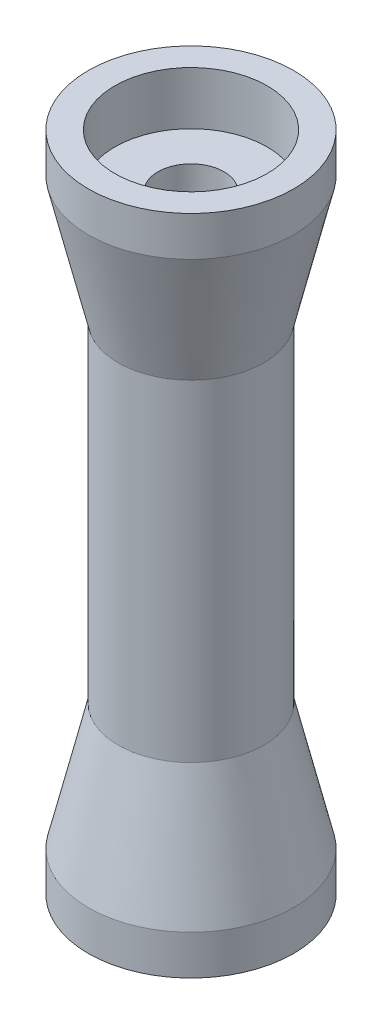
ISO-10303-21;
HEADER;
FILE_DESCRIPTION(('STEP AP214'),'2;1');
FILE_NAME('part.step','',(''),(''),'','','');
FILE_SCHEMA(('AUTOMOTIVE_DESIGN { 1 0 10303 214 1 1 1 1 }'));
ENDSEC;
DATA;
#1=APPLICATION_CONTEXT('core data for automotive mechanical design processes');
#2=APPLICATION_PROTOCOL_DEFINITION('international standard','automotive_design',2000,#1);
#3=PRODUCT_CONTEXT('',#1,'mechanical');
#4=PRODUCT('Part','Part','',(#3));
#5=PRODUCT_RELATED_PRODUCT_CATEGORY('part','',(#4));
#6=PRODUCT_DEFINITION_FORMATION('','',#4);
#7=PRODUCT_DEFINITION_CONTEXT('part definition',#1,'design');
#8=PRODUCT_DEFINITION('design','',#6,#7);
#9=PRODUCT_DEFINITION_SHAPE('','',#8);
#10=(LENGTH_UNIT() NAMED_UNIT(*) SI_UNIT(.MILLI.,.METRE.));
#11=(NAMED_UNIT(*) PLANE_ANGLE_UNIT() SI_UNIT($,.RADIAN.));
#12=(NAMED_UNIT(*) SI_UNIT($,.STERADIAN.) SOLID_ANGLE_UNIT());
#13=UNCERTAINTY_MEASURE_WITH_UNIT(LENGTH_MEASURE(1.E-05),#10,'distance_accuracy_value','');
#14=(GEOMETRIC_REPRESENTATION_CONTEXT(3) GLOBAL_UNCERTAINTY_ASSIGNED_CONTEXT((#13)) GLOBAL_UNIT_ASSIGNED_CONTEXT((#10,
#11,#12)) REPRESENTATION_CONTEXT('',''));
#15=CARTESIAN_POINT('',(0.,0.,0.));
#16=DIRECTION('',(0.,0.,1.));
#17=DIRECTION('',(1.,0.,0.));
#18=AXIS2_PLACEMENT_3D('',#15,#16,#17);
#19=CARTESIAN_POINT('',(0.,0.,0.));
#20=DIRECTION('',(0.,-1.,0.));
#21=DIRECTION('',(0.,0.,-1.));
#22=AXIS2_PLACEMENT_3D('',#19,#20,#21);
#23=CYLINDRICAL_SURFACE('',#22,5.);
#24=CARTESIAN_POINT('',(0.,7.99999999999999,0.));
#25=DIRECTION('',(0.,-1.,0.));
#26=DIRECTION('',(0.,0.,-1.));
#27=AXIS2_PLACEMENT_3D('',#24,#25,#26);
#28=CIRCLE('',#27,5.);
#29=CARTESIAN_POINT('',(0.,7.99999999999999,-5.));
#30=VERTEX_POINT('',#29);
#31=EDGE_CURVE('E10',#30,#30,#28,.T.);
#32=ORIENTED_EDGE('',*,*,#31,.T.);
#33=EDGE_LOOP('',(#32));
#34=FACE_BOUND('',#33,.T.);
#35=CARTESIAN_POINT('',(0.,92.,0.));
#36=DIRECTION('',(0.,-1.,0.));
#37=DIRECTION('',(0.,0.,-1.));
#38=AXIS2_PLACEMENT_3D('',#35,#36,#37);
#39=CIRCLE('',#38,5.);
#40=CARTESIAN_POINT('',(0.,92.,-5.));
#41=VERTEX_POINT('',#40);
#42=EDGE_CURVE('E70',#41,#41,#39,.T.);
#43=ORIENTED_EDGE('',*,*,#42,.F.);
#44=EDGE_LOOP('',(#43));
#45=FACE_BOUND('',#44,.T.);
#46=ADVANCED_FACE('F30',(#34,#45),#23,.F.);
#47=CARTESIAN_POINT('',(11.5,7.99999999999999,0.));
#48=DIRECTION('',(0.,-1.,0.));
#49=DIRECTION('',(0.,0.,-1.));
#50=AXIS2_PLACEMENT_3D('',#47,#48,#49);
#51=PLANE('',#50);
#52=CARTESIAN_POINT('',(0.,7.99999999999999,0.));
#53=DIRECTION('',(0.,-1.,0.));
#54=DIRECTION('',(0.,0.,-1.));
#55=AXIS2_PLACEMENT_3D('',#52,#53,#54);
#56=CIRCLE('',#55,11.5);
#57=CARTESIAN_POINT('',(0.,7.99999999999999,-11.5));
#58=VERTEX_POINT('',#57);
#59=EDGE_CURVE('E36',#58,#58,#56,.T.);
#60=ORIENTED_EDGE('',*,*,#59,.T.);
#61=EDGE_LOOP('',(#60));
#62=FACE_BOUND('',#61,.T.);
#63=ORIENTED_EDGE('',*,*,#31,.F.);
#64=EDGE_LOOP('',(#63));
#65=FACE_BOUND('',#64,.T.);
#66=ADVANCED_FACE('F78',(#62,#65),#51,.T.);
#67=CARTESIAN_POINT('',(0.,0.,0.));
#68=DIRECTION('',(0.,-1.,0.));
#69=DIRECTION('',(0.,0.,-1.));
#70=AXIS2_PLACEMENT_3D('',#67,#68,#69);
#71=CYLINDRICAL_SURFACE('',#70,11.5);
#72=CARTESIAN_POINT('',(0.,0.,0.));
#73=DIRECTION('',(0.,-1.,0.));
#74=DIRECTION('',(0.,0.,-1.));
#75=AXIS2_PLACEMENT_3D('',#72,#73,#74);
#76=CIRCLE('',#75,11.5);
#77=CARTESIAN_POINT('',(0.,0.,-11.5));
#78=VERTEX_POINT('',#77);
#79=EDGE_CURVE('E40',#78,#78,#76,.T.);
#80=ORIENTED_EDGE('',*,*,#79,.T.);
#81=EDGE_LOOP('',(#80));
#82=FACE_BOUND('',#81,.T.);
#83=ORIENTED_EDGE('',*,*,#59,.F.);
#84=EDGE_LOOP('',(#83));
#85=FACE_BOUND('',#84,.T.);
#86=ADVANCED_FACE('F82',(#82,#85),#71,.F.);
#87=CARTESIAN_POINT('',(15.5,0.,0.));
#88=DIRECTION('',(0.,-1.,0.));
#89=DIRECTION('',(0.,0.,-1.));
#90=AXIS2_PLACEMENT_3D('',#87,#88,#89);
#91=PLANE('',#90);
#92=CARTESIAN_POINT('',(0.,0.,0.));
#93=DIRECTION('',(0.,-1.,0.));
#94=DIRECTION('',(0.,0.,-1.));
#95=AXIS2_PLACEMENT_3D('',#92,#93,#94);
#96=CIRCLE('',#95,15.5);
#97=CARTESIAN_POINT('',(0.,0.,-15.5));
#98=VERTEX_POINT('',#97);
#99=EDGE_CURVE('E44',#98,#98,#96,.T.);
#100=ORIENTED_EDGE('',*,*,#99,.T.);
#101=EDGE_LOOP('',(#100));
#102=FACE_BOUND('',#101,.T.);
#103=ORIENTED_EDGE('',*,*,#79,.F.);
#104=EDGE_LOOP('',(#103));
#105=FACE_BOUND('',#104,.T.);
#106=ADVANCED_FACE('F86',(#102,#105),#91,.T.);
#107=CARTESIAN_POINT('',(0.,0.,0.));
#108=DIRECTION('',(0.,-1.,0.));
#109=DIRECTION('',(0.,0.,-1.));
#110=AXIS2_PLACEMENT_3D('',#107,#108,#109);
#111=CYLINDRICAL_SURFACE('',#110,15.5);
#112=CARTESIAN_POINT('',(0.,6.,0.));
#113=DIRECTION('',(0.,-1.,0.));
#114=DIRECTION('',(0.,0.,-1.));
#115=AXIS2_PLACEMENT_3D('',#112,#113,#114);
#116=CIRCLE('',#115,15.5);
#117=CARTESIAN_POINT('',(0.,6.,-15.5));
#118=VERTEX_POINT('',#117);
#119=EDGE_CURVE('E49',#118,#118,#116,.T.);
#120=ORIENTED_EDGE('',*,*,#119,.T.);
#121=EDGE_LOOP('',(#120));
#122=FACE_BOUND('',#121,.T.);
#123=ORIENTED_EDGE('',*,*,#99,.F.);
#124=EDGE_LOOP('',(#123));
#125=FACE_BOUND('',#124,.T.);
#126=ADVANCED_FACE('F93',(#122,#125),#111,.T.);
#127=CARTESIAN_POINT('',(0.,6.,0.));
#128=DIRECTION('',(0.,-1.,0.));
#129=DIRECTION('',(0.,0.,-1.));
#130=AXIS2_PLACEMENT_3D('',#127,#128,#129);
#131=CONICAL_SURFACE('',#130,15.5,0.232556941804909);
#132=CARTESIAN_POINT('',(0.,25.,0.));
#133=DIRECTION('',(0.,-1.,0.));
#134=DIRECTION('',(0.,0.,-1.));
#135=AXIS2_PLACEMENT_3D('',#132,#133,#134);
#136=CIRCLE('',#135,11.);
#137=CARTESIAN_POINT('',(0.,25.,-11.));
#138=VERTEX_POINT('',#137);
#139=EDGE_CURVE('E52',#138,#138,#136,.T.);
#140=ORIENTED_EDGE('',*,*,#139,.T.);
#141=EDGE_LOOP('',(#140));
#142=FACE_BOUND('',#141,.T.);
#143=ORIENTED_EDGE('',*,*,#119,.F.);
#144=EDGE_LOOP('',(#143));
#145=FACE_BOUND('',#144,.T.);
#146=ADVANCED_FACE('F97',(#142,#145),#131,.T.);
#147=CARTESIAN_POINT('',(0.,0.,0.));
#148=DIRECTION('',(0.,-1.,0.));
#149=DIRECTION('',(0.,0.,-1.));
#150=AXIS2_PLACEMENT_3D('',#147,#148,#149);
#151=CYLINDRICAL_SURFACE('',#150,11.);
#152=CARTESIAN_POINT('',(0.,75.,0.));
#153=DIRECTION('',(0.,-1.,0.));
#154=DIRECTION('',(0.,0.,-1.));
#155=AXIS2_PLACEMENT_3D('',#152,#153,#154);
#156=CIRCLE('',#155,11.);
#157=CARTESIAN_POINT('',(0.,75.,-11.));
#158=VERTEX_POINT('',#157);
#159=EDGE_CURVE('E55',#158,#158,#156,.T.);
#160=ORIENTED_EDGE('',*,*,#159,.T.);
#161=EDGE_LOOP('',(#160));
#162=FACE_BOUND('',#161,.T.);
#163=ORIENTED_EDGE('',*,*,#139,.F.);
#164=EDGE_LOOP('',(#163));
#165=FACE_BOUND('',#164,.T.);
#166=ADVANCED_FACE('F101',(#162,#165),#151,.T.);
#167=CARTESIAN_POINT('',(0.,75.,0.));
#168=DIRECTION('',(0.,1.,0.));
#169=DIRECTION('',(0.,0.,1.));
#170=AXIS2_PLACEMENT_3D('',#167,#168,#169);
#171=CONICAL_SURFACE('',#170,11.,0.232556941804909);
#172=CARTESIAN_POINT('',(0.,94.,0.));
#173=DIRECTION('',(0.,-1.,0.));
#174=DIRECTION('',(0.,0.,-1.));
#175=AXIS2_PLACEMENT_3D('',#172,#173,#174);
#176=CIRCLE('',#175,15.5);
#177=CARTESIAN_POINT('',(0.,94.,-15.5));
#178=VERTEX_POINT('',#177);
#179=EDGE_CURVE('E58',#178,#178,#176,.T.);
#180=ORIENTED_EDGE('',*,*,#179,.T.);
#181=EDGE_LOOP('',(#180));
#182=FACE_BOUND('',#181,.T.);
#183=ORIENTED_EDGE('',*,*,#159,.F.);
#184=EDGE_LOOP('',(#183));
#185=FACE_BOUND('',#184,.T.);
#186=ADVANCED_FACE('F105',(#182,#185),#171,.T.);
#187=CARTESIAN_POINT('',(0.,0.,0.));
#188=DIRECTION('',(0.,-1.,0.));
#189=DIRECTION('',(0.,0.,-1.));
#190=AXIS2_PLACEMENT_3D('',#187,#188,#189);
#191=CYLINDRICAL_SURFACE('',#190,15.5);
#192=CARTESIAN_POINT('',(0.,100.,0.));
#193=DIRECTION('',(0.,-1.,0.));
#194=DIRECTION('',(0.,0.,-1.));
#195=AXIS2_PLACEMENT_3D('',#192,#193,#194);
#196=CIRCLE('',#195,15.5);
#197=CARTESIAN_POINT('',(0.,100.,-15.5));
#198=VERTEX_POINT('',#197);
#199=EDGE_CURVE('E61',#198,#198,#196,.T.);
#200=ORIENTED_EDGE('',*,*,#199,.T.);
#201=EDGE_LOOP('',(#200));
#202=FACE_BOUND('',#201,.T.);
#203=ORIENTED_EDGE('',*,*,#179,.F.);
#204=EDGE_LOOP('',(#203));
#205=FACE_BOUND('',#204,.T.);
#206=ADVANCED_FACE('F109',(#202,#205),#191,.T.);
#207=CARTESIAN_POINT('',(15.5,100.,0.));
#208=DIRECTION('',(0.,1.,0.));
#209=DIRECTION('',(0.,0.,1.));
#210=AXIS2_PLACEMENT_3D('',#207,#208,#209);
#211=PLANE('',#210);
#212=CARTESIAN_POINT('',(0.,100.,0.));
#213=DIRECTION('',(0.,-1.,0.));
#214=DIRECTION('',(0.,0.,-1.));
#215=AXIS2_PLACEMENT_3D('',#212,#213,#214);
#216=CIRCLE('',#215,11.5);
#217=CARTESIAN_POINT('',(0.,100.,-11.5));
#218=VERTEX_POINT('',#217);
#219=EDGE_CURVE('E64',#218,#218,#216,.T.);
#220=ORIENTED_EDGE('',*,*,#219,.T.);
#221=EDGE_LOOP('',(#220));
#222=FACE_BOUND('',#221,.T.);
#223=ORIENTED_EDGE('',*,*,#199,.F.);
#224=EDGE_LOOP('',(#223));
#225=FACE_BOUND('',#224,.T.);
#226=ADVANCED_FACE('F113',(#222,#225),#211,.T.);
#227=CARTESIAN_POINT('',(0.,0.,0.));
#228=DIRECTION('',(0.,-1.,0.));
#229=DIRECTION('',(0.,0.,-1.));
#230=AXIS2_PLACEMENT_3D('',#227,#228,#229);
#231=CYLINDRICAL_SURFACE('',#230,11.5);
#232=CARTESIAN_POINT('',(0.,92.,0.));
#233=DIRECTION('',(0.,-1.,0.));
#234=DIRECTION('',(0.,0.,-1.));
#235=AXIS2_PLACEMENT_3D('',#232,#233,#234);
#236=CIRCLE('',#235,11.5);
#237=CARTESIAN_POINT('',(0.,92.,-11.5));
#238=VERTEX_POINT('',#237);
#239=EDGE_CURVE('E67',#238,#238,#236,.T.);
#240=ORIENTED_EDGE('',*,*,#239,.T.);
#241=EDGE_LOOP('',(#240));
#242=FACE_BOUND('',#241,.T.);
#243=ORIENTED_EDGE('',*,*,#219,.F.);
#244=EDGE_LOOP('',(#243));
#245=FACE_BOUND('',#244,.T.);
#246=ADVANCED_FACE('F117',(#242,#245),#231,.F.);
#247=CARTESIAN_POINT('',(11.5,92.,0.));
#248=DIRECTION('',(0.,1.,0.));
#249=DIRECTION('',(0.,0.,1.));
#250=AXIS2_PLACEMENT_3D('',#247,#248,#249);
#251=PLANE('',#250);
#252=ORIENTED_EDGE('',*,*,#42,.T.);
#253=EDGE_LOOP('',(#252));
#254=FACE_BOUND('',#253,.T.);
#255=ORIENTED_EDGE('',*,*,#239,.F.);
#256=EDGE_LOOP('',(#255));
#257=FACE_BOUND('',#256,.T.);
#258=ADVANCED_FACE('F74',(#254,#257),#251,.T.);
#259=CLOSED_SHELL('',(#46,#66,#86,#106,#126,#146,#166,#186,#206,#226,#246,#258));
#260=MANIFOLD_SOLID_BREP('B2',#259);
#261=ADVANCED_BREP_SHAPE_REPRESENTATION('',(#18,#260),#14);
#262=SHAPE_DEFINITION_REPRESENTATION(#9,#261);
ENDSEC;
END-ISO-10303-21;
